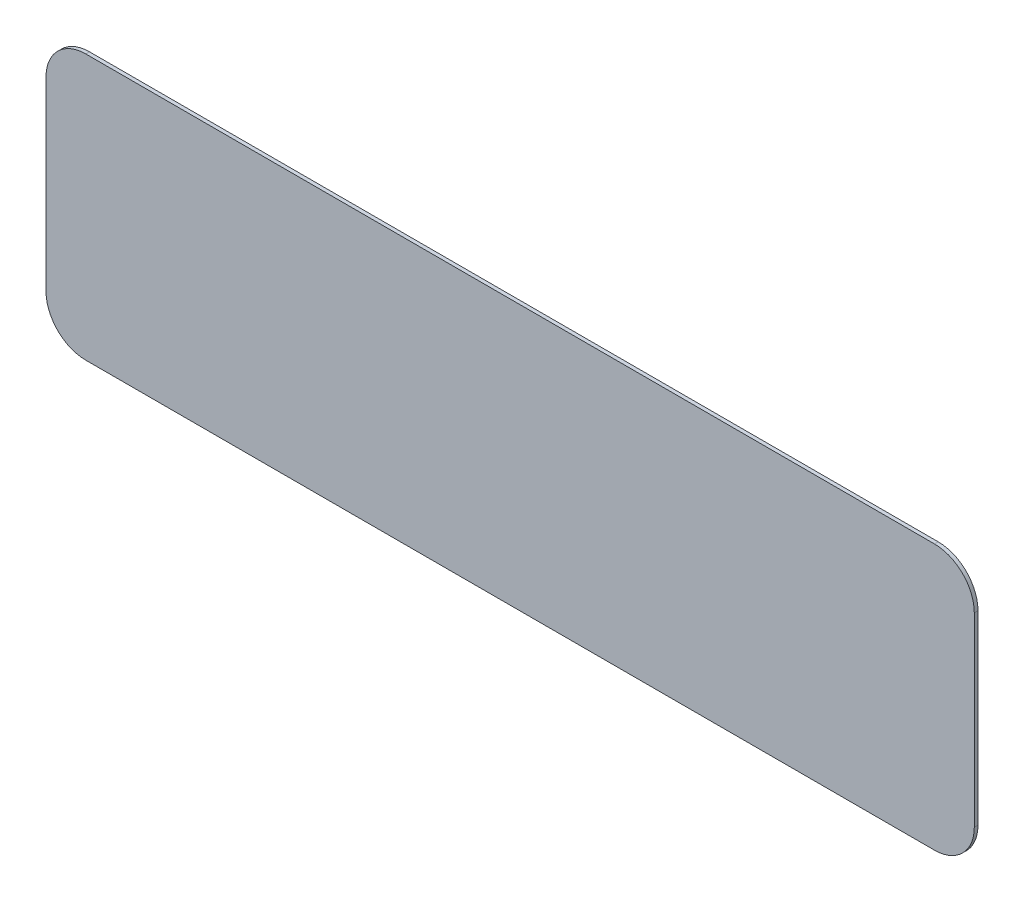
ISO-10303-21;
HEADER;
FILE_DESCRIPTION(('STEP AP214'),'2;1');
FILE_NAME('part.step','',(''),(''),'','','');
FILE_SCHEMA(('AUTOMOTIVE_DESIGN { 1 0 10303 214 1 1 1 1 }'));
ENDSEC;
DATA;
#1=APPLICATION_CONTEXT('core data for automotive mechanical design processes');
#2=APPLICATION_PROTOCOL_DEFINITION('international standard','automotive_design',2000,#1);
#3=PRODUCT_CONTEXT('',#1,'mechanical');
#4=PRODUCT('Part','Part','',(#3));
#5=PRODUCT_RELATED_PRODUCT_CATEGORY('part','',(#4));
#6=PRODUCT_DEFINITION_FORMATION('','',#4);
#7=PRODUCT_DEFINITION_CONTEXT('part definition',#1,'design');
#8=PRODUCT_DEFINITION('design','',#6,#7);
#9=PRODUCT_DEFINITION_SHAPE('','',#8);
#10=(LENGTH_UNIT() NAMED_UNIT(*) SI_UNIT(.MILLI.,.METRE.));
#11=(NAMED_UNIT(*) PLANE_ANGLE_UNIT() SI_UNIT($,.RADIAN.));
#12=(NAMED_UNIT(*) SI_UNIT($,.STERADIAN.) SOLID_ANGLE_UNIT());
#13=UNCERTAINTY_MEASURE_WITH_UNIT(LENGTH_MEASURE(1.E-05),#10,'distance_accuracy_value','');
#14=(GEOMETRIC_REPRESENTATION_CONTEXT(3) GLOBAL_UNCERTAINTY_ASSIGNED_CONTEXT((#13)) GLOBAL_UNIT_ASSIGNED_CONTEXT((#10,
#11,#12)) REPRESENTATION_CONTEXT('',''));
#15=CARTESIAN_POINT('',(0.,0.,0.));
#16=DIRECTION('',(0.,0.,1.));
#17=DIRECTION('',(1.,0.,0.));
#18=AXIS2_PLACEMENT_3D('',#15,#16,#17);
#19=CARTESIAN_POINT('',(20.32,4.445,0.1778));
#20=DIRECTION('',(0.,0.,-1.));
#21=DIRECTION('',(-1.,0.,0.));
#22=AXIS2_PLACEMENT_3D('',#19,#20,#21);
#23=CYLINDRICAL_SURFACE('',#22,1.905);
#24=CARTESIAN_POINT('',(20.32,4.445,0.));
#25=DIRECTION('',(0.,0.,1.));
#26=DIRECTION('',(-1.,0.,0.));
#27=AXIS2_PLACEMENT_3D('',#24,#25,#26);
#28=CIRCLE('',#27,1.905);
#29=CARTESIAN_POINT('',(22.225,4.445,0.));
#30=VERTEX_POINT('',#29);
#31=CARTESIAN_POINT('',(20.32,6.35,0.));
#32=VERTEX_POINT('',#31);
#33=EDGE_CURVE('E130',#30,#32,#28,.T.);
#34=ORIENTED_EDGE('',*,*,#33,.T.);
#35=DIRECTION('',(0.,0.,-1.));
#36=VECTOR('',#35,1.);
#37=CARTESIAN_POINT('',(20.32,6.35,0.1778));
#38=LINE('',#37,#36);
#39=CARTESIAN_POINT('',(20.32,6.35,0.1778));
#40=VERTEX_POINT('',#39);
#41=EDGE_CURVE('E11',#40,#32,#38,.T.);
#42=ORIENTED_EDGE('',*,*,#41,.F.);
#43=CARTESIAN_POINT('',(20.32,4.445,0.1778));
#44=DIRECTION('',(0.,0.,1.));
#45=DIRECTION('',(-1.,0.,0.));
#46=AXIS2_PLACEMENT_3D('',#43,#44,#45);
#47=CIRCLE('',#46,1.905);
#48=CARTESIAN_POINT('',(22.225,4.445,0.1778));
#49=VERTEX_POINT('',#48);
#50=EDGE_CURVE('E144',#49,#40,#47,.T.);
#51=ORIENTED_EDGE('',*,*,#50,.F.);
#52=DIRECTION('',(0.,0.,-1.));
#53=VECTOR('',#52,1.);
#54=CARTESIAN_POINT('',(22.225,4.445,0.1778));
#55=LINE('',#54,#53);
#56=EDGE_CURVE('E126',#49,#30,#55,.T.);
#57=ORIENTED_EDGE('',*,*,#56,.T.);
#58=EDGE_LOOP('',(#34,#42,#51,#57));
#59=FACE_BOUND('',#58,.T.);
#60=ADVANCED_FACE('F34',(#59),#23,.T.);
#61=CARTESIAN_POINT('',(-20.32,6.35,0.1778));
#62=DIRECTION('',(0.,-1.,0.));
#63=DIRECTION('',(0.,0.,-1.));
#64=AXIS2_PLACEMENT_3D('',#61,#62,#63);
#65=PLANE('',#64);
#66=DIRECTION('',(-1.,0.,0.));
#67=VECTOR('',#66,1.);
#68=CARTESIAN_POINT('',(-20.32,6.35,0.));
#69=LINE('',#68,#67);
#70=CARTESIAN_POINT('',(-20.32,6.35,0.));
#71=VERTEX_POINT('',#70);
#72=EDGE_CURVE('E133',#32,#71,#69,.T.);
#73=ORIENTED_EDGE('',*,*,#72,.T.);
#74=DIRECTION('',(0.,0.,-1.));
#75=VECTOR('',#74,1.);
#76=CARTESIAN_POINT('',(-20.32,6.35,0.1778));
#77=LINE('',#76,#75);
#78=CARTESIAN_POINT('',(-20.32,6.35,0.1778));
#79=VERTEX_POINT('',#78);
#80=EDGE_CURVE('E42',#79,#71,#77,.T.);
#81=ORIENTED_EDGE('',*,*,#80,.F.);
#82=DIRECTION('',(-1.,0.,0.));
#83=VECTOR('',#82,1.);
#84=CARTESIAN_POINT('',(-20.32,6.35,0.1778));
#85=LINE('',#84,#83);
#86=EDGE_CURVE('E93',#40,#79,#85,.T.);
#87=ORIENTED_EDGE('',*,*,#86,.F.);
#88=ORIENTED_EDGE('',*,*,#41,.T.);
#89=EDGE_LOOP('',(#73,#81,#87,#88));
#90=FACE_BOUND('',#89,.T.);
#91=ADVANCED_FACE('F179',(#90),#65,.F.);
#92=CARTESIAN_POINT('',(-20.32,4.445,0.1778));
#93=DIRECTION('',(0.,0.,-1.));
#94=DIRECTION('',(-1.,0.,0.));
#95=AXIS2_PLACEMENT_3D('',#92,#93,#94);
#96=CYLINDRICAL_SURFACE('',#95,1.905);
#97=CARTESIAN_POINT('',(-20.32,4.445,0.));
#98=DIRECTION('',(0.,0.,1.));
#99=DIRECTION('',(-1.,0.,0.));
#100=AXIS2_PLACEMENT_3D('',#97,#98,#99);
#101=CIRCLE('',#100,1.905);
#102=CARTESIAN_POINT('',(-22.225,4.445,0.));
#103=VERTEX_POINT('',#102);
#104=EDGE_CURVE('E135',#71,#103,#101,.T.);
#105=ORIENTED_EDGE('',*,*,#104,.T.);
#106=DIRECTION('',(0.,0.,-1.));
#107=VECTOR('',#106,1.);
#108=CARTESIAN_POINT('',(-22.225,4.445,0.1778));
#109=LINE('',#108,#107);
#110=CARTESIAN_POINT('',(-22.225,4.445,0.1778));
#111=VERTEX_POINT('',#110);
#112=EDGE_CURVE('E151',#111,#103,#109,.T.);
#113=ORIENTED_EDGE('',*,*,#112,.F.);
#114=CARTESIAN_POINT('',(-20.32,4.445,0.1778));
#115=DIRECTION('',(0.,0.,1.));
#116=DIRECTION('',(-1.,0.,0.));
#117=AXIS2_PLACEMENT_3D('',#114,#115,#116);
#118=CIRCLE('',#117,1.905);
#119=EDGE_CURVE('E159',#79,#111,#118,.T.);
#120=ORIENTED_EDGE('',*,*,#119,.F.);
#121=ORIENTED_EDGE('',*,*,#80,.T.);
#122=EDGE_LOOP('',(#105,#113,#120,#121));
#123=FACE_BOUND('',#122,.T.);
#124=ADVANCED_FACE('F157',(#123),#96,.T.);
#125=CARTESIAN_POINT('',(-22.225,-4.445,0.1778));
#126=DIRECTION('',(1.,0.,0.));
#127=DIRECTION('',(0.,0.,-1.));
#128=AXIS2_PLACEMENT_3D('',#125,#126,#127);
#129=PLANE('',#128);
#130=DIRECTION('',(0.,-1.,0.));
#131=VECTOR('',#130,1.);
#132=CARTESIAN_POINT('',(-22.225,-4.445,0.));
#133=LINE('',#132,#131);
#134=CARTESIAN_POINT('',(-22.225,-4.445,0.));
#135=VERTEX_POINT('',#134);
#136=EDGE_CURVE('E137',#103,#135,#133,.T.);
#137=ORIENTED_EDGE('',*,*,#136,.T.);
#138=DIRECTION('',(0.,0.,-1.));
#139=VECTOR('',#138,1.);
#140=CARTESIAN_POINT('',(-22.225,-4.445,0.1778));
#141=LINE('',#140,#139);
#142=CARTESIAN_POINT('',(-22.225,-4.445,0.1778));
#143=VERTEX_POINT('',#142);
#144=EDGE_CURVE('E148',#143,#135,#141,.T.);
#145=ORIENTED_EDGE('',*,*,#144,.F.);
#146=DIRECTION('',(0.,-1.,0.));
#147=VECTOR('',#146,1.);
#148=CARTESIAN_POINT('',(-22.225,-4.445,0.1778));
#149=LINE('',#148,#147);
#150=EDGE_CURVE('E171',#111,#143,#149,.T.);
#151=ORIENTED_EDGE('',*,*,#150,.F.);
#152=ORIENTED_EDGE('',*,*,#112,.T.);
#153=EDGE_LOOP('',(#137,#145,#151,#152));
#154=FACE_BOUND('',#153,.T.);
#155=ADVANCED_FACE('F167',(#154),#129,.F.);
#156=CARTESIAN_POINT('',(-20.32,-4.445,0.1778));
#157=DIRECTION('',(0.,0.,-1.));
#158=DIRECTION('',(-1.,0.,0.));
#159=AXIS2_PLACEMENT_3D('',#156,#157,#158);
#160=CYLINDRICAL_SURFACE('',#159,1.905);
#161=CARTESIAN_POINT('',(-20.32,-4.445,0.));
#162=DIRECTION('',(0.,0.,1.));
#163=DIRECTION('',(-1.,0.,0.));
#164=AXIS2_PLACEMENT_3D('',#161,#162,#163);
#165=CIRCLE('',#164,1.905);
#166=CARTESIAN_POINT('',(-20.32,-6.35,0.));
#167=VERTEX_POINT('',#166);
#168=EDGE_CURVE('E139',#135,#167,#165,.T.);
#169=ORIENTED_EDGE('',*,*,#168,.T.);
#170=DIRECTION('',(0.,0.,-1.));
#171=VECTOR('',#170,1.);
#172=CARTESIAN_POINT('',(-20.32,-6.35,0.1778));
#173=LINE('',#172,#171);
#174=CARTESIAN_POINT('',(-20.32,-6.35,0.1778));
#175=VERTEX_POINT('',#174);
#176=EDGE_CURVE('E121',#175,#167,#173,.T.);
#177=ORIENTED_EDGE('',*,*,#176,.F.);
#178=CARTESIAN_POINT('',(-20.32,-4.445,0.1778));
#179=DIRECTION('',(0.,0.,1.));
#180=DIRECTION('',(-1.,0.,0.));
#181=AXIS2_PLACEMENT_3D('',#178,#179,#180);
#182=CIRCLE('',#181,1.905);
#183=EDGE_CURVE('E112',#143,#175,#182,.T.);
#184=ORIENTED_EDGE('',*,*,#183,.F.);
#185=ORIENTED_EDGE('',*,*,#144,.T.);
#186=EDGE_LOOP('',(#169,#177,#184,#185));
#187=FACE_BOUND('',#186,.T.);
#188=ADVANCED_FACE('F170',(#187),#160,.T.);
#189=CARTESIAN_POINT('',(-20.32,-6.35,0.1778));
#190=DIRECTION('',(0.,1.,0.));
#191=DIRECTION('',(0.,0.,1.));
#192=AXIS2_PLACEMENT_3D('',#189,#190,#191);
#193=PLANE('',#192);
#194=DIRECTION('',(1.,0.,0.));
#195=VECTOR('',#194,1.);
#196=CARTESIAN_POINT('',(-20.32,-6.35,0.));
#197=LINE('',#196,#195);
#198=CARTESIAN_POINT('',(20.32,-6.35,0.));
#199=VERTEX_POINT('',#198);
#200=EDGE_CURVE('E120',#167,#199,#197,.T.);
#201=ORIENTED_EDGE('',*,*,#200,.T.);
#202=DIRECTION('',(0.,0.,-1.));
#203=VECTOR('',#202,1.);
#204=CARTESIAN_POINT('',(20.32,-6.35,0.1778));
#205=LINE('',#204,#203);
#206=CARTESIAN_POINT('',(20.32,-6.35,0.1778));
#207=VERTEX_POINT('',#206);
#208=EDGE_CURVE('E117',#207,#199,#205,.T.);
#209=ORIENTED_EDGE('',*,*,#208,.F.);
#210=DIRECTION('',(1.,0.,0.));
#211=VECTOR('',#210,1.);
#212=CARTESIAN_POINT('',(-20.32,-6.35,0.1778));
#213=LINE('',#212,#211);
#214=EDGE_CURVE('E106',#175,#207,#213,.T.);
#215=ORIENTED_EDGE('',*,*,#214,.F.);
#216=ORIENTED_EDGE('',*,*,#176,.T.);
#217=EDGE_LOOP('',(#201,#209,#215,#216));
#218=FACE_BOUND('',#217,.T.);
#219=ADVANCED_FACE('F118',(#218),#193,.F.);
#220=CARTESIAN_POINT('',(20.32,-4.445,0.1778));
#221=DIRECTION('',(0.,0.,-1.));
#222=DIRECTION('',(-1.,0.,0.));
#223=AXIS2_PLACEMENT_3D('',#220,#221,#222);
#224=CYLINDRICAL_SURFACE('',#223,1.905);
#225=CARTESIAN_POINT('',(20.32,-4.445,0.));
#226=DIRECTION('',(0.,0.,1.));
#227=DIRECTION('',(1.,0.,0.));
#228=AXIS2_PLACEMENT_3D('',#225,#226,#227);
#229=CIRCLE('',#228,1.905);
#230=CARTESIAN_POINT('',(22.225,-4.445,0.));
#231=VERTEX_POINT('',#230);
#232=EDGE_CURVE('E79',#199,#231,#229,.T.);
#233=ORIENTED_EDGE('',*,*,#232,.T.);
#234=DIRECTION('',(0.,0.,-1.));
#235=VECTOR('',#234,1.);
#236=CARTESIAN_POINT('',(22.225,-4.445,0.1778));
#237=LINE('',#236,#235);
#238=CARTESIAN_POINT('',(22.225,-4.445,0.1778));
#239=VERTEX_POINT('',#238);
#240=EDGE_CURVE('E122',#239,#231,#237,.T.);
#241=ORIENTED_EDGE('',*,*,#240,.F.);
#242=CARTESIAN_POINT('',(20.32,-4.445,0.1778));
#243=DIRECTION('',(0.,0.,1.));
#244=DIRECTION('',(1.,0.,0.));
#245=AXIS2_PLACEMENT_3D('',#242,#243,#244);
#246=CIRCLE('',#245,1.905);
#247=EDGE_CURVE('E110',#207,#239,#246,.T.);
#248=ORIENTED_EDGE('',*,*,#247,.F.);
#249=ORIENTED_EDGE('',*,*,#208,.T.);
#250=EDGE_LOOP('',(#233,#241,#248,#249));
#251=FACE_BOUND('',#250,.T.);
#252=ADVANCED_FACE('F124',(#251),#224,.T.);
#253=CARTESIAN_POINT('',(22.225,-4.445,0.1778));
#254=DIRECTION('',(-1.,0.,0.));
#255=DIRECTION('',(0.,0.,1.));
#256=AXIS2_PLACEMENT_3D('',#253,#254,#255);
#257=PLANE('',#256);
#258=DIRECTION('',(0.,1.,0.));
#259=VECTOR('',#258,1.);
#260=CARTESIAN_POINT('',(22.225,-4.445,0.));
#261=LINE('',#260,#259);
#262=EDGE_CURVE('E85',#231,#30,#261,.T.);
#263=ORIENTED_EDGE('',*,*,#262,.T.);
#264=ORIENTED_EDGE('',*,*,#56,.F.);
#265=DIRECTION('',(0.,1.,0.));
#266=VECTOR('',#265,1.);
#267=CARTESIAN_POINT('',(22.225,-4.445,0.1778));
#268=LINE('',#267,#266);
#269=EDGE_CURVE('E50',#239,#49,#268,.T.);
#270=ORIENTED_EDGE('',*,*,#269,.F.);
#271=ORIENTED_EDGE('',*,*,#240,.T.);
#272=EDGE_LOOP('',(#263,#264,#270,#271));
#273=FACE_BOUND('',#272,.T.);
#274=ADVANCED_FACE('F195',(#273),#257,.F.);
#275=CARTESIAN_POINT('',(20.32,4.445,0.1778));
#276=DIRECTION('',(0.,0.,-1.));
#277=DIRECTION('',(-1.,0.,0.));
#278=AXIS2_PLACEMENT_3D('',#275,#276,#277);
#279=PLANE('',#278);
#280=ORIENTED_EDGE('',*,*,#50,.T.);
#281=ORIENTED_EDGE('',*,*,#86,.T.);
#282=ORIENTED_EDGE('',*,*,#119,.T.);
#283=ORIENTED_EDGE('',*,*,#150,.T.);
#284=ORIENTED_EDGE('',*,*,#183,.T.);
#285=ORIENTED_EDGE('',*,*,#214,.T.);
#286=ORIENTED_EDGE('',*,*,#247,.T.);
#287=ORIENTED_EDGE('',*,*,#269,.T.);
#288=EDGE_LOOP('',(#280,#281,#282,#283,#284,#285,#286,#287));
#289=FACE_BOUND('',#288,.T.);
#290=ADVANCED_FACE('F108',(#289),#279,.F.);
#291=CARTESIAN_POINT('',(20.32,4.445,0.));
#292=DIRECTION('',(0.,0.,-1.));
#293=DIRECTION('',(-1.,0.,0.));
#294=AXIS2_PLACEMENT_3D('',#291,#292,#293);
#295=PLANE('',#294);
#296=ORIENTED_EDGE('',*,*,#33,.F.);
#297=ORIENTED_EDGE('',*,*,#262,.F.);
#298=ORIENTED_EDGE('',*,*,#232,.F.);
#299=ORIENTED_EDGE('',*,*,#200,.F.);
#300=ORIENTED_EDGE('',*,*,#168,.F.);
#301=ORIENTED_EDGE('',*,*,#136,.F.);
#302=ORIENTED_EDGE('',*,*,#104,.F.);
#303=ORIENTED_EDGE('',*,*,#72,.F.);
#304=EDGE_LOOP('',(#296,#297,#298,#299,#300,#301,#302,#303));
#305=FACE_BOUND('',#304,.T.);
#306=ADVANCED_FACE('F163',(#305),#295,.T.);
#307=CLOSED_SHELL('',(#60,#91,#124,#155,#188,#219,#252,#274,#290,#306));
#308=MANIFOLD_SOLID_BREP('B2',#307);
#309=ADVANCED_BREP_SHAPE_REPRESENTATION('',(#18,#308),#14);
#310=SHAPE_DEFINITION_REPRESENTATION(#9,#309);
ENDSEC;
END-ISO-10303-21;
